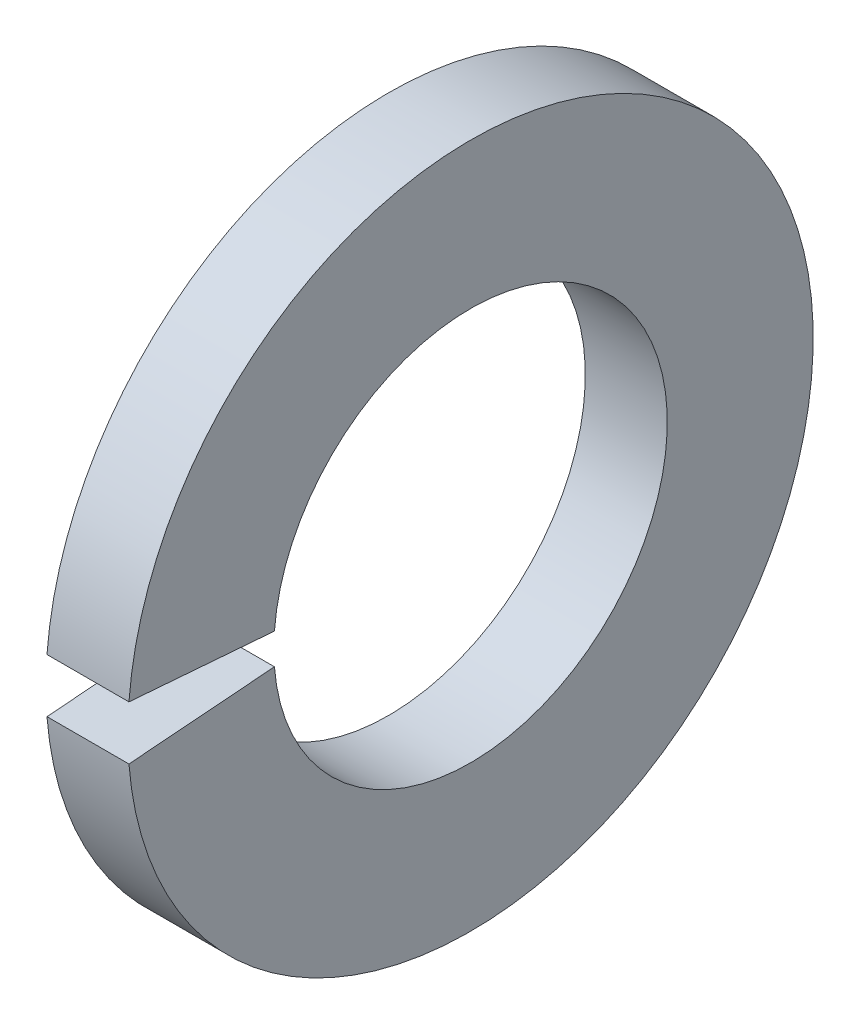
ISO-10303-21;
HEADER;
FILE_DESCRIPTION(('STEP AP214'),'2;1');
FILE_NAME('part.step','',(''),(''),'','','');
FILE_SCHEMA(('AUTOMOTIVE_DESIGN { 1 0 10303 214 1 1 1 1 }'));
ENDSEC;
DATA;
#1=APPLICATION_CONTEXT('core data for automotive mechanical design processes');
#2=APPLICATION_PROTOCOL_DEFINITION('international standard','automotive_design',2000,#1);
#3=PRODUCT_CONTEXT('',#1,'mechanical');
#4=PRODUCT('Part','Part','',(#3));
#5=PRODUCT_RELATED_PRODUCT_CATEGORY('part','',(#4));
#6=PRODUCT_DEFINITION_FORMATION('','',#4);
#7=PRODUCT_DEFINITION_CONTEXT('part definition',#1,'design');
#8=PRODUCT_DEFINITION('design','',#6,#7);
#9=PRODUCT_DEFINITION_SHAPE('','',#8);
#10=(LENGTH_UNIT() NAMED_UNIT(*) SI_UNIT(.MILLI.,.METRE.));
#11=(NAMED_UNIT(*) PLANE_ANGLE_UNIT() SI_UNIT($,.RADIAN.));
#12=(NAMED_UNIT(*) SI_UNIT($,.STERADIAN.) SOLID_ANGLE_UNIT());
#13=UNCERTAINTY_MEASURE_WITH_UNIT(LENGTH_MEASURE(1.E-05),#10,'distance_accuracy_value','');
#14=(GEOMETRIC_REPRESENTATION_CONTEXT(3) GLOBAL_UNCERTAINTY_ASSIGNED_CONTEXT((#13)) GLOBAL_UNIT_ASSIGNED_CONTEXT((#10,
#11,#12)) REPRESENTATION_CONTEXT('',''));
#15=CARTESIAN_POINT('',(0.,0.,0.));
#16=DIRECTION('',(0.,0.,1.));
#17=DIRECTION('',(1.,0.,0.));
#18=AXIS2_PLACEMENT_3D('',#15,#16,#17);
#19=CARTESIAN_POINT('',(-34.9249999999999,0.,0.));
#20=DIRECTION('',(-1.,0.,0.));
#21=DIRECTION('',(0.,0.,1.));
#22=AXIS2_PLACEMENT_3D('',#19,#20,#21);
#23=CYLINDRICAL_SURFACE('',#22,1.524);
#24=CARTESIAN_POINT('',(0.,0.,0.));
#25=DIRECTION('',(-1.,0.,0.));
#26=DIRECTION('',(0.,0.,1.));
#27=AXIS2_PLACEMENT_3D('',#24,#25,#26);
#28=CIRCLE('',#27,1.524);
#29=CARTESIAN_POINT('',(0.,0.119571661889237,1.51930201660929));
#30=VERTEX_POINT('',#29);
#31=CARTESIAN_POINT('',(0.,-0.119571661889237,1.51930201660929));
#32=VERTEX_POINT('',#31);
#33=EDGE_CURVE('E81',#30,#32,#28,.T.);
#34=ORIENTED_EDGE('',*,*,#33,.F.);
#35=DIRECTION('',(-1.,0.,0.));
#36=VECTOR('',#35,1.);
#37=CARTESIAN_POINT('',(-34.9249999999999,0.119571661889237,1.51930201660929));
#38=LINE('',#37,#36);
#39=CARTESIAN_POINT('',(-0.635,0.119571661889237,1.51930201660929));
#40=VERTEX_POINT('',#39);
#41=EDGE_CURVE('E103',#30,#40,#38,.T.);
#42=ORIENTED_EDGE('',*,*,#41,.T.);
#43=CARTESIAN_POINT('',(-0.634999999999997,0.,0.));
#44=DIRECTION('',(-1.,0.,0.));
#45=DIRECTION('',(0.,0.,1.));
#46=AXIS2_PLACEMENT_3D('',#43,#44,#45);
#47=CIRCLE('',#46,1.524);
#48=CARTESIAN_POINT('',(-0.634999999999997,-0.119571661889237,1.51930201660929));
#49=VERTEX_POINT('',#48);
#50=EDGE_CURVE('E83',#40,#49,#47,.T.);
#51=ORIENTED_EDGE('',*,*,#50,.T.);
#52=DIRECTION('',(-1.,0.,0.));
#53=VECTOR('',#52,1.);
#54=CARTESIAN_POINT('',(-34.9249999999999,-0.119571661889237,1.51930201660929));
#55=LINE('',#54,#53);
#56=EDGE_CURVE('E44',#32,#49,#55,.T.);
#57=ORIENTED_EDGE('',*,*,#56,.F.);
#58=EDGE_LOOP('',(#34,#42,#51,#57));
#59=FACE_BOUND('',#58,.T.);
#60=ADVANCED_FACE('F15',(#59),#23,.F.);
#61=CARTESIAN_POINT('',(0.,1.524,0.));
#62=DIRECTION('',(-1.,0.,0.));
#63=DIRECTION('',(0.,0.,1.));
#64=AXIS2_PLACEMENT_3D('',#61,#62,#63);
#65=PLANE('',#64);
#66=CARTESIAN_POINT('',(0.,0.,0.));
#67=DIRECTION('',(-1.,0.,0.));
#68=DIRECTION('',(0.,0.,1.));
#69=AXIS2_PLACEMENT_3D('',#66,#67,#68);
#70=CIRCLE('',#69,2.6543);
#71=CARTESIAN_POINT('',(0.,0.208253977790421,2.64611767892784));
#72=VERTEX_POINT('',#71);
#73=CARTESIAN_POINT('',(0.,-0.208253977790421,2.64611767892784));
#74=VERTEX_POINT('',#73);
#75=EDGE_CURVE('E89',#72,#74,#70,.T.);
#76=ORIENTED_EDGE('',*,*,#75,.F.);
#77=DIRECTION('',(0.,0.0784590957278456,0.996917333733128));
#78=VECTOR('',#77,1.);
#79=CARTESIAN_POINT('',(0.,0.,0.));
#80=LINE('',#79,#78);
#81=EDGE_CURVE('E75',#30,#72,#80,.T.);
#82=ORIENTED_EDGE('',*,*,#81,.F.);
#83=ORIENTED_EDGE('',*,*,#33,.T.);
#84=DIRECTION('',(0.,-0.0784590957278456,0.996917333733128));
#85=VECTOR('',#84,1.);
#86=CARTESIAN_POINT('',(0.,0.,0.));
#87=LINE('',#86,#85);
#88=EDGE_CURVE('E66',#32,#74,#87,.T.);
#89=ORIENTED_EDGE('',*,*,#88,.T.);
#90=EDGE_LOOP('',(#76,#82,#83,#89));
#91=FACE_BOUND('',#90,.T.);
#92=ADVANCED_FACE('F87',(#91),#65,.F.);
#93=CARTESIAN_POINT('',(-34.9249999999999,0.,0.));
#94=DIRECTION('',(-1.,0.,0.));
#95=DIRECTION('',(0.,0.,1.));
#96=AXIS2_PLACEMENT_3D('',#93,#94,#95);
#97=CYLINDRICAL_SURFACE('',#96,2.6543);
#98=CARTESIAN_POINT('',(-0.634999999999997,0.,0.));
#99=DIRECTION('',(-1.,0.,0.));
#100=DIRECTION('',(0.,0.,1.));
#101=AXIS2_PLACEMENT_3D('',#98,#99,#100);
#102=CIRCLE('',#101,2.6543);
#103=CARTESIAN_POINT('',(-0.634999999999997,0.208253977790421,2.64611767892784));
#104=VERTEX_POINT('',#103);
#105=CARTESIAN_POINT('',(-0.635,-0.208253977790421,2.64611767892784));
#106=VERTEX_POINT('',#105);
#107=EDGE_CURVE('E95',#104,#106,#102,.T.);
#108=ORIENTED_EDGE('',*,*,#107,.F.);
#109=DIRECTION('',(-1.,0.,0.));
#110=VECTOR('',#109,1.);
#111=CARTESIAN_POINT('',(-34.9249999999999,0.208253977790421,2.64611767892784));
#112=LINE('',#111,#110);
#113=EDGE_CURVE('E35',#104,#72,#112,.F.);
#114=ORIENTED_EDGE('',*,*,#113,.T.);
#115=ORIENTED_EDGE('',*,*,#75,.T.);
#116=DIRECTION('',(-1.,0.,0.));
#117=VECTOR('',#116,1.);
#118=CARTESIAN_POINT('',(-34.9249999999999,-0.208253977790421,2.64611767892784));
#119=LINE('',#118,#117);
#120=EDGE_CURVE('E69',#106,#74,#119,.F.);
#121=ORIENTED_EDGE('',*,*,#120,.F.);
#122=EDGE_LOOP('',(#108,#114,#115,#121));
#123=FACE_BOUND('',#122,.T.);
#124=ADVANCED_FACE('F114',(#123),#97,.T.);
#125=CARTESIAN_POINT('',(-0.634999999999998,2.6543,0.));
#126=DIRECTION('',(1.,0.,0.));
#127=DIRECTION('',(0.,0.,-1.));
#128=AXIS2_PLACEMENT_3D('',#125,#126,#127);
#129=PLANE('',#128);
#130=ORIENTED_EDGE('',*,*,#50,.F.);
#131=DIRECTION('',(0.,0.0784590957278456,0.996917333733128));
#132=VECTOR('',#131,1.);
#133=CARTESIAN_POINT('',(-0.634999999999998,0.0163394187791635,0.207612000278144));
#134=LINE('',#133,#132);
#135=EDGE_CURVE('E10',#40,#104,#134,.T.);
#136=ORIENTED_EDGE('',*,*,#135,.T.);
#137=ORIENTED_EDGE('',*,*,#107,.T.);
#138=DIRECTION('',(0.,-0.0784590957278456,0.996917333733128));
#139=VECTOR('',#138,1.);
#140=CARTESIAN_POINT('',(-0.634999999999998,0.0163394187791635,-0.207612000278144));
#141=LINE('',#140,#139);
#142=EDGE_CURVE('E23',#49,#106,#141,.T.);
#143=ORIENTED_EDGE('',*,*,#142,.F.);
#144=EDGE_LOOP('',(#130,#136,#137,#143));
#145=FACE_BOUND('',#144,.T.);
#146=ADVANCED_FACE('F116',(#145),#129,.F.);
#147=CARTESIAN_POINT('',(-0.635,0.,0.));
#148=DIRECTION('',(0.,0.996917333733128,0.0784590957278456));
#149=DIRECTION('',(0.,-0.0784590957278456,0.996917333733128));
#150=AXIS2_PLACEMENT_3D('',#147,#148,#149);
#151=PLANE('',#150);
#152=ORIENTED_EDGE('',*,*,#56,.T.);
#153=ORIENTED_EDGE('',*,*,#142,.T.);
#154=ORIENTED_EDGE('',*,*,#120,.T.);
#155=ORIENTED_EDGE('',*,*,#88,.F.);
#156=EDGE_LOOP('',(#152,#153,#154,#155));
#157=FACE_BOUND('',#156,.T.);
#158=ADVANCED_FACE('F67',(#157),#151,.T.);
#159=CARTESIAN_POINT('',(-0.635,0.,0.));
#160=DIRECTION('',(0.,0.996917333733128,-0.0784590957278456));
#161=DIRECTION('',(0.,0.0784590957278456,0.996917333733128));
#162=AXIS2_PLACEMENT_3D('',#159,#160,#161);
#163=PLANE('',#162);
#164=ORIENTED_EDGE('',*,*,#81,.T.);
#165=ORIENTED_EDGE('',*,*,#113,.F.);
#166=ORIENTED_EDGE('',*,*,#135,.F.);
#167=ORIENTED_EDGE('',*,*,#41,.F.);
#168=EDGE_LOOP('',(#164,#165,#166,#167));
#169=FACE_BOUND('',#168,.T.);
#170=ADVANCED_FACE('F111',(#169),#163,.F.);
#171=CLOSED_SHELL('',(#60,#92,#124,#146,#158,#170));
#172=MANIFOLD_SOLID_BREP('B1',#171);
#173=ADVANCED_BREP_SHAPE_REPRESENTATION('',(#18,#172),#14);
#174=SHAPE_DEFINITION_REPRESENTATION(#9,#173);
ENDSEC;
END-ISO-10303-21;
